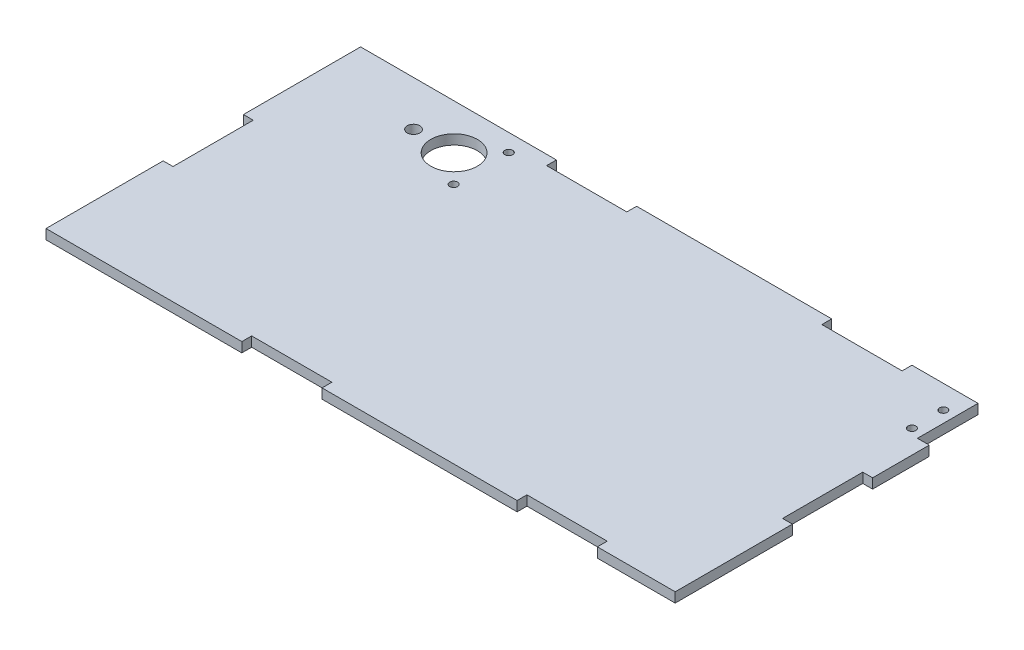
ISO-10303-21;
HEADER;
FILE_DESCRIPTION(('STEP AP214'),'2;1');
FILE_NAME('part.step','',(''),(''),'','','');
FILE_SCHEMA(('AUTOMOTIVE_DESIGN { 1 0 10303 214 1 1 1 1 }'));
ENDSEC;
DATA;
#1=APPLICATION_CONTEXT('core data for automotive mechanical design processes');
#2=APPLICATION_PROTOCOL_DEFINITION('international standard','automotive_design',2000,#1);
#3=PRODUCT_CONTEXT('',#1,'mechanical');
#4=PRODUCT('Part','Part','',(#3));
#5=PRODUCT_RELATED_PRODUCT_CATEGORY('part','',(#4));
#6=PRODUCT_DEFINITION_FORMATION('','',#4);
#7=PRODUCT_DEFINITION_CONTEXT('part definition',#1,'design');
#8=PRODUCT_DEFINITION('design','',#6,#7);
#9=PRODUCT_DEFINITION_SHAPE('','',#8);
#10=(LENGTH_UNIT() NAMED_UNIT(*) SI_UNIT(.MILLI.,.METRE.));
#11=(NAMED_UNIT(*) PLANE_ANGLE_UNIT() SI_UNIT($,.RADIAN.));
#12=(NAMED_UNIT(*) SI_UNIT($,.STERADIAN.) SOLID_ANGLE_UNIT());
#13=UNCERTAINTY_MEASURE_WITH_UNIT(LENGTH_MEASURE(1.E-05),#10,'distance_accuracy_value','');
#14=(GEOMETRIC_REPRESENTATION_CONTEXT(3) GLOBAL_UNCERTAINTY_ASSIGNED_CONTEXT((#13)) GLOBAL_UNIT_ASSIGNED_CONTEXT((#10,
#11,#12)) REPRESENTATION_CONTEXT('',''));
#15=CARTESIAN_POINT('',(0.,0.,0.));
#16=DIRECTION('',(0.,0.,1.));
#17=DIRECTION('',(1.,0.,0.));
#18=AXIS2_PLACEMENT_3D('',#15,#16,#17);
#19=CARTESIAN_POINT('',(127.875862068966,3.175,-50.3620689655172));
#20=DIRECTION('',(-1.,0.,0.));
#21=DIRECTION('',(0.,0.,1.));
#22=AXIS2_PLACEMENT_3D('',#19,#20,#21);
#23=PLANE('',#22);
#24=DIRECTION('',(0.,0.,-1.));
#25=VECTOR('',#24,1.);
#26=CARTESIAN_POINT('',(127.875862068966,0.,-50.3620689655172));
#27=LINE('',#26,#25);
#28=CARTESIAN_POINT('',(127.875862068966,0.,51.2379310344828));
#29=VERTEX_POINT('',#28);
#30=CARTESIAN_POINT('',(127.875862068966,0.,13.3919310344828));
#31=VERTEX_POINT('',#30);
#32=EDGE_CURVE('E478',#29,#31,#27,.T.);
#33=ORIENTED_EDGE('',*,*,#32,.T.);
#34=DIRECTION('',(0.,-1.,0.));
#35=VECTOR('',#34,1.);
#36=CARTESIAN_POINT('',(127.875862068966,0.,13.3919310344828));
#37=LINE('',#36,#35);
#38=CARTESIAN_POINT('',(127.875862068966,3.175,13.3919310344828));
#39=VERTEX_POINT('',#38);
#40=EDGE_CURVE('E257',#39,#31,#37,.T.);
#41=ORIENTED_EDGE('',*,*,#40,.F.);
#42=DIRECTION('',(0.,0.,-1.));
#43=VECTOR('',#42,1.);
#44=CARTESIAN_POINT('',(127.875862068966,3.175,-50.3620689655172));
#45=LINE('',#44,#43);
#46=CARTESIAN_POINT('',(127.875862068966,3.175,51.2379310344828));
#47=VERTEX_POINT('',#46);
#48=EDGE_CURVE('E461',#47,#39,#45,.T.);
#49=ORIENTED_EDGE('',*,*,#48,.F.);
#50=DIRECTION('',(0.,-1.,0.));
#51=VECTOR('',#50,1.);
#52=CARTESIAN_POINT('',(127.875862068966,3.175,51.2379310344828));
#53=LINE('',#52,#51);
#54=EDGE_CURVE('E42',#47,#29,#53,.T.);
#55=ORIENTED_EDGE('',*,*,#54,.T.);
#56=EDGE_LOOP('',(#33,#41,#49,#55));
#57=FACE_BOUND('',#56,.T.);
#58=ADVANCED_FACE('F34',(#57),#23,.F.);
#59=CARTESIAN_POINT('',(-75.3241379310345,3.175,-50.3620689655172));
#60=DIRECTION('',(1.,0.,0.));
#61=DIRECTION('',(0.,0.,-1.));
#62=AXIS2_PLACEMENT_3D('',#59,#60,#61);
#63=PLANE('',#62);
#64=DIRECTION('',(0.,0.,1.));
#65=VECTOR('',#64,1.);
#66=CARTESIAN_POINT('',(-75.3241379310345,3.175,-50.3620689655172));
#67=LINE('',#66,#65);
#68=CARTESIAN_POINT('',(-75.3241379310345,3.175,13.3919310344828));
#69=VERTEX_POINT('',#68);
#70=CARTESIAN_POINT('',(-75.3241379310345,3.175,51.2379310344828));
#71=VERTEX_POINT('',#70);
#72=EDGE_CURVE('E456',#69,#71,#67,.T.);
#73=ORIENTED_EDGE('',*,*,#72,.F.);
#74=DIRECTION('',(0.,1.,0.));
#75=VECTOR('',#74,1.);
#76=CARTESIAN_POINT('',(-75.3241379310345,3.175,13.3919310344828));
#77=LINE('',#76,#75);
#78=CARTESIAN_POINT('',(-75.3241379310345,0.,13.3919310344828));
#79=VERTEX_POINT('',#78);
#80=EDGE_CURVE('E278',#79,#69,#77,.T.);
#81=ORIENTED_EDGE('',*,*,#80,.F.);
#82=DIRECTION('',(0.,0.,1.));
#83=VECTOR('',#82,1.);
#84=CARTESIAN_POINT('',(-75.3241379310345,0.,-50.3620689655172));
#85=LINE('',#84,#83);
#86=CARTESIAN_POINT('',(-75.3241379310345,0.,51.2379310344828));
#87=VERTEX_POINT('',#86);
#88=EDGE_CURVE('E449',#79,#87,#85,.T.);
#89=ORIENTED_EDGE('',*,*,#88,.T.);
#90=DIRECTION('',(0.,-1.,0.));
#91=VECTOR('',#90,1.);
#92=CARTESIAN_POINT('',(-75.3241379310345,3.175,51.2379310344828));
#93=LINE('',#92,#91);
#94=EDGE_CURVE('E11',#71,#87,#93,.T.);
#95=ORIENTED_EDGE('',*,*,#94,.F.);
#96=EDGE_LOOP('',(#73,#81,#89,#95));
#97=FACE_BOUND('',#96,.T.);
#98=ADVANCED_FACE('F539',(#97),#63,.F.);
#99=CARTESIAN_POINT('',(-75.3241379310345,3.175,51.2379310344828));
#100=DIRECTION('',(0.,0.,-1.));
#101=DIRECTION('',(-1.,0.,0.));
#102=AXIS2_PLACEMENT_3D('',#99,#100,#101);
#103=PLANE('',#102);
#104=DIRECTION('',(1.,0.,0.));
#105=VECTOR('',#104,1.);
#106=CARTESIAN_POINT('',(-75.3241379310345,3.175,51.2379310344828));
#107=LINE('',#106,#105);
#108=CARTESIAN_POINT('',(13.8298620689655,3.175,51.2379310344828));
#109=VERTEX_POINT('',#108);
#110=CARTESIAN_POINT('',(76.8218620689655,3.175,51.2379310344828));
#111=VERTEX_POINT('',#110);
#112=EDGE_CURVE('E460',#109,#111,#107,.T.);
#113=ORIENTED_EDGE('',*,*,#112,.F.);
#114=DIRECTION('',(0.,1.,0.));
#115=VECTOR('',#114,1.);
#116=CARTESIAN_POINT('',(13.8298620689655,0.,51.2379310344828));
#117=LINE('',#116,#115);
#118=CARTESIAN_POINT('',(13.8298620689655,0.,51.2379310344828));
#119=VERTEX_POINT('',#118);
#120=EDGE_CURVE('E324',#119,#109,#117,.T.);
#121=ORIENTED_EDGE('',*,*,#120,.F.);
#122=DIRECTION('',(1.,0.,0.));
#123=VECTOR('',#122,1.);
#124=CARTESIAN_POINT('',(-75.3241379310345,0.,51.2379310344828));
#125=LINE('',#124,#123);
#126=CARTESIAN_POINT('',(76.8218620689655,0.,51.2379310344828));
#127=VERTEX_POINT('',#126);
#128=EDGE_CURVE('E477',#119,#127,#125,.T.);
#129=ORIENTED_EDGE('',*,*,#128,.T.);
#130=DIRECTION('',(0.,-1.,0.));
#131=VECTOR('',#130,1.);
#132=CARTESIAN_POINT('',(76.8218620689655,0.,51.2379310344828));
#133=LINE('',#132,#131);
#134=EDGE_CURVE('E342',#111,#127,#133,.T.);
#135=ORIENTED_EDGE('',*,*,#134,.F.);
#136=EDGE_LOOP('',(#113,#121,#129,#135));
#137=FACE_BOUND('',#136,.T.);
#138=ADVANCED_FACE('F516',(#137),#103,.F.);
#139=CARTESIAN_POINT('',(102.729862068966,3.17499999999999,51.2379310344828));
#140=VERTEX_POINT('',#139);
#141=EDGE_CURVE('E455',#140,#47,#107,.T.);
#142=ORIENTED_EDGE('',*,*,#141,.F.);
#143=DIRECTION('',(0.,1.,0.));
#144=VECTOR('',#143,1.);
#145=CARTESIAN_POINT('',(102.729862068966,0.,51.2379310344828));
#146=LINE('',#145,#144);
#147=CARTESIAN_POINT('',(102.729862068966,0.,51.2379310344828));
#148=VERTEX_POINT('',#147);
#149=EDGE_CURVE('E302',#148,#140,#146,.T.);
#150=ORIENTED_EDGE('',*,*,#149,.F.);
#151=EDGE_CURVE('E472',#148,#29,#125,.T.);
#152=ORIENTED_EDGE('',*,*,#151,.T.);
#153=ORIENTED_EDGE('',*,*,#54,.F.);
#154=EDGE_LOOP('',(#142,#150,#152,#153));
#155=FACE_BOUND('',#154,.T.);
#156=ADVANCED_FACE('F527',(#155),#103,.F.);
#157=CARTESIAN_POINT('',(-75.3241379310345,3.175,-50.3620689655172));
#158=DIRECTION('',(0.,0.,1.));
#159=DIRECTION('',(1.,0.,0.));
#160=AXIS2_PLACEMENT_3D('',#157,#158,#159);
#161=PLANE('',#160);
#162=DIRECTION('',(-1.,0.,0.));
#163=VECTOR('',#162,1.);
#164=CARTESIAN_POINT('',(-75.3241379310345,3.175,-50.3620689655172));
#165=LINE('',#164,#163);
#166=CARTESIAN_POINT('',(124.065862068966,3.175,-50.3620689655172));
#167=VERTEX_POINT('',#166);
#168=CARTESIAN_POINT('',(102.729862068966,3.175,-50.3620689655172));
#169=VERTEX_POINT('',#168);
#170=EDGE_CURVE('E465',#167,#169,#165,.T.);
#171=ORIENTED_EDGE('',*,*,#170,.F.);
#172=DIRECTION('',(0.,-1.,0.));
#173=VECTOR('',#172,1.);
#174=CARTESIAN_POINT('',(124.065862068966,3.175,-50.3620689655172));
#175=LINE('',#174,#173);
#176=CARTESIAN_POINT('',(124.065862068966,0.,-50.3620689655172));
#177=VERTEX_POINT('',#176);
#178=EDGE_CURVE('E236',#167,#177,#175,.T.);
#179=ORIENTED_EDGE('',*,*,#178,.T.);
#180=DIRECTION('',(-1.,0.,0.));
#181=VECTOR('',#180,1.);
#182=CARTESIAN_POINT('',(-75.3241379310345,0.,-50.3620689655172));
#183=LINE('',#182,#181);
#184=CARTESIAN_POINT('',(102.729862068966,0.,-50.3620689655172));
#185=VERTEX_POINT('',#184);
#186=EDGE_CURVE('E482',#177,#185,#183,.T.);
#187=ORIENTED_EDGE('',*,*,#186,.T.);
#188=DIRECTION('',(0.,-1.,0.));
#189=VECTOR('',#188,1.);
#190=CARTESIAN_POINT('',(102.729862068966,3.175,-50.3620689655172));
#191=LINE('',#190,#189);
#192=EDGE_CURVE('E376',#169,#185,#191,.T.);
#193=ORIENTED_EDGE('',*,*,#192,.F.);
#194=EDGE_LOOP('',(#171,#179,#187,#193));
#195=FACE_BOUND('',#194,.T.);
#196=ADVANCED_FACE('F529',(#195),#161,.F.);
#197=CARTESIAN_POINT('',(76.8218620689655,3.175,-50.3620689655172));
#198=VERTEX_POINT('',#197);
#199=CARTESIAN_POINT('',(13.8298620689655,3.175,-50.3620689655172));
#200=VERTEX_POINT('',#199);
#201=EDGE_CURVE('E468',#198,#200,#165,.T.);
#202=ORIENTED_EDGE('',*,*,#201,.F.);
#203=DIRECTION('',(0.,1.,0.));
#204=VECTOR('',#203,1.);
#205=CARTESIAN_POINT('',(76.8218620689655,3.175,-50.3620689655172));
#206=LINE('',#205,#204);
#207=CARTESIAN_POINT('',(76.8218620689655,0.,-50.3620689655172));
#208=VERTEX_POINT('',#207);
#209=EDGE_CURVE('E366',#208,#198,#206,.T.);
#210=ORIENTED_EDGE('',*,*,#209,.F.);
#211=CARTESIAN_POINT('',(13.8298620689655,0.,-50.3620689655172));
#212=VERTEX_POINT('',#211);
#213=EDGE_CURVE('E484',#208,#212,#183,.T.);
#214=ORIENTED_EDGE('',*,*,#213,.T.);
#215=DIRECTION('',(0.,-1.,0.));
#216=VECTOR('',#215,1.);
#217=CARTESIAN_POINT('',(13.8298620689655,3.175,-50.3620689655172));
#218=LINE('',#217,#216);
#219=EDGE_CURVE('E330',#200,#212,#218,.T.);
#220=ORIENTED_EDGE('',*,*,#219,.F.);
#221=EDGE_LOOP('',(#202,#210,#214,#220));
#222=FACE_BOUND('',#221,.T.);
#223=ADVANCED_FACE('F535',(#222),#161,.F.);
#224=CARTESIAN_POINT('',(0.,3.175,0.));
#225=DIRECTION('',(0.,1.,0.));
#226=DIRECTION('',(0.,0.,1.));
#227=AXIS2_PLACEMENT_3D('',#224,#225,#226);
#228=PLANE('',#227);
#229=DIRECTION('',(0.,0.,-1.));
#230=VECTOR('',#229,1.);
#231=CARTESIAN_POINT('',(124.065862068966,3.175,-50.3620689655172));
#232=LINE('',#231,#230);
#233=CARTESIAN_POINT('',(124.065862068966,3.175,-30.8040689655172));
#234=VERTEX_POINT('',#233);
#235=EDGE_CURVE('E240',#234,#167,#232,.T.);
#236=ORIENTED_EDGE('',*,*,#235,.T.);
#237=ORIENTED_EDGE('',*,*,#170,.T.);
#238=DIRECTION('',(0.,0.,-1.));
#239=VECTOR('',#238,1.);
#240=CARTESIAN_POINT('',(102.729862068966,3.175,-47.1870689655172));
#241=LINE('',#240,#239);
#242=CARTESIAN_POINT('',(102.729862068966,3.175,-47.1870689655172));
#243=VERTEX_POINT('',#242);
#244=EDGE_CURVE('E381',#243,#169,#241,.T.);
#245=ORIENTED_EDGE('',*,*,#244,.F.);
#246=DIRECTION('',(1.,0.,0.));
#247=VECTOR('',#246,1.);
#248=CARTESIAN_POINT('',(102.729862068966,3.175,-47.1870689655172));
#249=LINE('',#248,#247);
#250=CARTESIAN_POINT('',(76.8218620689655,3.175,-47.1870689655172));
#251=VERTEX_POINT('',#250);
#252=EDGE_CURVE('E372',#251,#243,#249,.T.);
#253=ORIENTED_EDGE('',*,*,#252,.F.);
#254=DIRECTION('',(0.,0.,-1.));
#255=VECTOR('',#254,1.);
#256=CARTESIAN_POINT('',(76.8218620689655,3.175,-47.1870689655172));
#257=LINE('',#256,#255);
#258=EDGE_CURVE('E385',#251,#198,#257,.T.);
#259=ORIENTED_EDGE('',*,*,#258,.T.);
#260=ORIENTED_EDGE('',*,*,#201,.T.);
#261=DIRECTION('',(0.,0.,-1.));
#262=VECTOR('',#261,1.);
#263=CARTESIAN_POINT('',(13.8298620689655,3.175,-47.1870689655172));
#264=LINE('',#263,#262);
#265=CARTESIAN_POINT('',(13.8298620689655,3.175,-47.1870689655172));
#266=VERTEX_POINT('',#265);
#267=EDGE_CURVE('E379',#266,#200,#264,.T.);
#268=ORIENTED_EDGE('',*,*,#267,.F.);
#269=DIRECTION('',(1.,0.,0.));
#270=VECTOR('',#269,1.);
#271=CARTESIAN_POINT('',(13.8298620689655,3.175,-47.1870689655172));
#272=LINE('',#271,#270);
#273=CARTESIAN_POINT('',(-12.0781379310345,3.175,-47.1870689655172));
#274=VERTEX_POINT('',#273);
#275=EDGE_CURVE('E402',#274,#266,#272,.T.);
#276=ORIENTED_EDGE('',*,*,#275,.F.);
#277=DIRECTION('',(0.,0.,-1.));
#278=VECTOR('',#277,1.);
#279=CARTESIAN_POINT('',(-12.0781379310345,3.175,-47.1870689655172));
#280=LINE('',#279,#278);
#281=CARTESIAN_POINT('',(-12.0781379310345,3.175,-50.3620689655172));
#282=VERTEX_POINT('',#281);
#283=EDGE_CURVE('E409',#274,#282,#280,.T.);
#284=ORIENTED_EDGE('',*,*,#283,.T.);
#285=CARTESIAN_POINT('',(-75.3241379310345,3.175,-50.3620689655172));
#286=VERTEX_POINT('',#285);
#287=EDGE_CURVE('E464',#282,#286,#165,.T.);
#288=ORIENTED_EDGE('',*,*,#287,.T.);
#289=CARTESIAN_POINT('',(-75.3241379310345,3.175,-12.5160689655172));
#290=VERTEX_POINT('',#289);
#291=EDGE_CURVE('E452',#286,#290,#67,.T.);
#292=ORIENTED_EDGE('',*,*,#291,.T.);
#293=DIRECTION('',(-1.,0.,0.));
#294=VECTOR('',#293,1.);
#295=CARTESIAN_POINT('',(-72.1491379310345,3.175,-12.5160689655172));
#296=LINE('',#295,#294);
#297=CARTESIAN_POINT('',(-72.1491379310345,3.175,-12.5160689655172));
#298=VERTEX_POINT('',#297);
#299=EDGE_CURVE('E306',#298,#290,#296,.T.);
#300=ORIENTED_EDGE('',*,*,#299,.F.);
#301=DIRECTION('',(0.,0.,-1.));
#302=VECTOR('',#301,1.);
#303=CARTESIAN_POINT('',(-72.1491379310345,3.175,13.3919310344828));
#304=LINE('',#303,#302);
#305=CARTESIAN_POINT('',(-72.1491379310345,3.175,13.3919310344828));
#306=VERTEX_POINT('',#305);
#307=EDGE_CURVE('E287',#306,#298,#304,.T.);
#308=ORIENTED_EDGE('',*,*,#307,.F.);
#309=DIRECTION('',(-1.,0.,0.));
#310=VECTOR('',#309,1.);
#311=CARTESIAN_POINT('',(-72.1491379310345,3.175,13.3919310344828));
#312=LINE('',#311,#310);
#313=EDGE_CURVE('E297',#306,#69,#312,.T.);
#314=ORIENTED_EDGE('',*,*,#313,.T.);
#315=ORIENTED_EDGE('',*,*,#72,.T.);
#316=CARTESIAN_POINT('',(-12.0781379310345,3.175,51.2379310344828));
#317=VERTEX_POINT('',#316);
#318=EDGE_CURVE('E457',#71,#317,#107,.T.);
#319=ORIENTED_EDGE('',*,*,#318,.T.);
#320=DIRECTION('',(0.,0.,1.));
#321=VECTOR('',#320,1.);
#322=CARTESIAN_POINT('',(-12.0781379310345,3.175,48.0629310344828));
#323=LINE('',#322,#321);
#324=CARTESIAN_POINT('',(-12.0781379310345,3.175,48.0629310344828));
#325=VERTEX_POINT('',#324);
#326=EDGE_CURVE('E334',#325,#317,#323,.T.);
#327=ORIENTED_EDGE('',*,*,#326,.F.);
#328=DIRECTION('',(-1.,0.,0.));
#329=VECTOR('',#328,1.);
#330=CARTESIAN_POINT('',(13.8298620689655,3.175,48.0629310344828));
#331=LINE('',#330,#329);
#332=CARTESIAN_POINT('',(13.8298620689655,3.175,48.0629310344828));
#333=VERTEX_POINT('',#332);
#334=EDGE_CURVE('E313',#333,#325,#331,.T.);
#335=ORIENTED_EDGE('',*,*,#334,.F.);
#336=DIRECTION('',(0.,0.,1.));
#337=VECTOR('',#336,1.);
#338=CARTESIAN_POINT('',(13.8298620689655,3.175,48.0629310344828));
#339=LINE('',#338,#337);
#340=EDGE_CURVE('E323',#333,#109,#339,.T.);
#341=ORIENTED_EDGE('',*,*,#340,.T.);
#342=ORIENTED_EDGE('',*,*,#112,.T.);
#343=DIRECTION('',(0.,0.,1.));
#344=VECTOR('',#343,1.);
#345=CARTESIAN_POINT('',(76.8218620689655,3.175,48.0629310344828));
#346=LINE('',#345,#344);
#347=CARTESIAN_POINT('',(76.8218620689655,3.175,48.0629310344828));
#348=VERTEX_POINT('',#347);
#349=EDGE_CURVE('E358',#348,#111,#346,.T.);
#350=ORIENTED_EDGE('',*,*,#349,.F.);
#351=DIRECTION('',(-1.,0.,0.));
#352=VECTOR('',#351,1.);
#353=CARTESIAN_POINT('',(102.729862068966,3.17499999999999,48.0629310344828));
#354=LINE('',#353,#352);
#355=CARTESIAN_POINT('',(102.729862068966,3.17499999999999,48.0629310344828));
#356=VERTEX_POINT('',#355);
#357=EDGE_CURVE('E341',#356,#348,#354,.T.);
#358=ORIENTED_EDGE('',*,*,#357,.F.);
#359=DIRECTION('',(0.,0.,1.));
#360=VECTOR('',#359,1.);
#361=CARTESIAN_POINT('',(102.729862068966,3.17499999999999,48.0629310344828));
#362=LINE('',#361,#360);
#363=EDGE_CURVE('E351',#356,#140,#362,.T.);
#364=ORIENTED_EDGE('',*,*,#363,.T.);
#365=ORIENTED_EDGE('',*,*,#141,.T.);
#366=ORIENTED_EDGE('',*,*,#48,.T.);
#367=DIRECTION('',(1.,0.,0.));
#368=VECTOR('',#367,1.);
#369=CARTESIAN_POINT('',(124.700862068966,3.175,13.3919310344828));
#370=LINE('',#369,#368);
#371=CARTESIAN_POINT('',(124.700862068966,3.175,13.3919310344828));
#372=VERTEX_POINT('',#371);
#373=EDGE_CURVE('E276',#372,#39,#370,.T.);
#374=ORIENTED_EDGE('',*,*,#373,.F.);
#375=DIRECTION('',(0.,0.,1.));
#376=VECTOR('',#375,1.);
#377=CARTESIAN_POINT('',(124.700862068966,3.175,13.3919310344828));
#378=LINE('',#377,#376);
#379=CARTESIAN_POINT('',(124.700862068966,3.175,-12.5160689655172));
#380=VERTEX_POINT('',#379);
#381=EDGE_CURVE('E270',#380,#372,#378,.T.);
#382=ORIENTED_EDGE('',*,*,#381,.F.);
#383=DIRECTION('',(1.,0.,0.));
#384=VECTOR('',#383,1.);
#385=CARTESIAN_POINT('',(124.700862068966,3.175,-12.5160689655172));
#386=LINE('',#385,#384);
#387=CARTESIAN_POINT('',(127.875862068966,3.175,-12.5160689655172));
#388=VERTEX_POINT('',#387);
#389=EDGE_CURVE('E279',#380,#388,#386,.T.);
#390=ORIENTED_EDGE('',*,*,#389,.T.);
#391=CARTESIAN_POINT('',(127.875862068966,3.175,-30.8040689655172));
#392=VERTEX_POINT('',#391);
#393=EDGE_CURVE('E251',#388,#392,#45,.T.);
#394=ORIENTED_EDGE('',*,*,#393,.T.);
#395=DIRECTION('',(-1.,0.,0.));
#396=VECTOR('',#395,1.);
#397=CARTESIAN_POINT('',(127.875862068966,3.175,-30.8040689655172));
#398=LINE('',#397,#396);
#399=EDGE_CURVE('E49',#392,#234,#398,.T.);
#400=ORIENTED_EDGE('',*,*,#399,.T.);
#401=EDGE_LOOP('',(#236,#237,#245,#253,#259,#260,#268,#276,#284,#288,#292,#300,#308,#314,#315,
#319,#327,#335,#341,#342,#350,#358,#364,#365,#366,#374,#382,#390,#394,#400));
#402=FACE_BOUND('',#401,.T.);
#403=CARTESIAN_POINT('',(-21.8591379310353,3.175,-44.7370689655172));
#404=DIRECTION('',(0.,1.,0.));
#405=DIRECTION('',(0.,0.,1.));
#406=AXIS2_PLACEMENT_3D('',#403,#404,#405);
#407=CIRCLE('',#406,1.27000000000001);
#408=CARTESIAN_POINT('',(-21.8591379310353,3.175,-43.4670689655172));
#409=VERTEX_POINT('',#408);
#410=EDGE_CURVE('E422',#409,#409,#407,.T.);
#411=ORIENTED_EDGE('',*,*,#410,.F.);
#412=EDGE_LOOP('',(#411));
#413=FACE_BOUND('',#412,.T.);
#414=CARTESIAN_POINT('',(-30.6091379310352,3.175,-35.8370689655172));
#415=DIRECTION('',(0.,1.,0.));
#416=DIRECTION('',(0.,0.,1.));
#417=AXIS2_PLACEMENT_3D('',#414,#415,#416);
#418=CIRCLE('',#417,7.51839999999999);
#419=CARTESIAN_POINT('',(-30.6091379310352,3.175,-28.3186689655172));
#420=VERTEX_POINT('',#419);
#421=EDGE_CURVE('E434',#420,#420,#418,.T.);
#422=ORIENTED_EDGE('',*,*,#421,.F.);
#423=EDGE_LOOP('',(#422));
#424=FACE_BOUND('',#423,.T.);
#425=CARTESIAN_POINT('',(120.357219560557,3.175,-32.7090689655172));
#426=DIRECTION('',(0.,1.,0.));
#427=DIRECTION('',(0.,0.,1.));
#428=AXIS2_PLACEMENT_3D('',#425,#426,#427);
#429=CIRCLE('',#428,1.27000000000004);
#430=CARTESIAN_POINT('',(120.357219560557,3.175,-31.4390689655171));
#431=VERTEX_POINT('',#430);
#432=EDGE_CURVE('E446',#431,#431,#429,.T.);
#433=ORIENTED_EDGE('',*,*,#432,.F.);
#434=EDGE_LOOP('',(#433));
#435=FACE_BOUND('',#434,.T.);
#436=CARTESIAN_POINT('',(120.357219560557,3.175,-42.8690689655172));
#437=DIRECTION('',(0.,1.,0.));
#438=DIRECTION('',(0.,0.,1.));
#439=AXIS2_PLACEMENT_3D('',#436,#437,#438);
#440=CIRCLE('',#439,1.27000000000006);
#441=CARTESIAN_POINT('',(120.357219560557,3.175,-41.5990689655171));
#442=VERTEX_POINT('',#441);
#443=EDGE_CURVE('E440',#442,#442,#440,.T.);
#444=ORIENTED_EDGE('',*,*,#443,.F.);
#445=EDGE_LOOP('',(#444));
#446=FACE_BOUND('',#445,.T.);
#447=CARTESIAN_POINT('',(-43.7091379310353,3.175,-35.8370689655172));
#448=DIRECTION('',(0.,1.,0.));
#449=DIRECTION('',(0.,0.,1.));
#450=AXIS2_PLACEMENT_3D('',#447,#448,#449);
#451=CIRCLE('',#450,2.03200000000001);
#452=CARTESIAN_POINT('',(-43.7091379310353,3.175,-33.8050689655172));
#453=VERTEX_POINT('',#452);
#454=EDGE_CURVE('E428',#453,#453,#451,.T.);
#455=ORIENTED_EDGE('',*,*,#454,.F.);
#456=EDGE_LOOP('',(#455));
#457=FACE_BOUND('',#456,.T.);
#458=CARTESIAN_POINT('',(-21.8591379310353,3.175,-26.9370689655172));
#459=DIRECTION('',(0.,1.,0.));
#460=DIRECTION('',(0.,0.,1.));
#461=AXIS2_PLACEMENT_3D('',#458,#459,#460);
#462=CIRCLE('',#461,1.27);
#463=CARTESIAN_POINT('',(-21.8591379310353,3.175,-25.6670689655172));
#464=VERTEX_POINT('',#463);
#465=EDGE_CURVE('E416',#464,#464,#462,.T.);
#466=ORIENTED_EDGE('',*,*,#465,.F.);
#467=EDGE_LOOP('',(#466));
#468=FACE_BOUND('',#467,.T.);
#469=ADVANCED_FACE('F247',(#402,#413,#424,#435,#446,#457,#468),#228,.T.);
#470=CARTESIAN_POINT('',(0.,0.,0.));
#471=DIRECTION('',(0.,1.,0.));
#472=DIRECTION('',(0.,0.,1.));
#473=AXIS2_PLACEMENT_3D('',#470,#471,#472);
#474=PLANE('',#473);
#475=ORIENTED_EDGE('',*,*,#186,.F.);
#476=DIRECTION('',(0.,0.,-1.));
#477=VECTOR('',#476,1.);
#478=CARTESIAN_POINT('',(124.065862068966,0.,-50.3620689655172));
#479=LINE('',#478,#477);
#480=CARTESIAN_POINT('',(124.065862068966,0.,-30.8040689655172));
#481=VERTEX_POINT('',#480);
#482=EDGE_CURVE('E252',#481,#177,#479,.T.);
#483=ORIENTED_EDGE('',*,*,#482,.F.);
#484=DIRECTION('',(-1.,0.,0.));
#485=VECTOR('',#484,1.);
#486=CARTESIAN_POINT('',(127.875862068966,0.,-30.8040689655172));
#487=LINE('',#486,#485);
#488=CARTESIAN_POINT('',(127.875862068966,0.,-30.8040689655172));
#489=VERTEX_POINT('',#488);
#490=EDGE_CURVE('E233',#489,#481,#487,.T.);
#491=ORIENTED_EDGE('',*,*,#490,.F.);
#492=CARTESIAN_POINT('',(127.875862068966,0.,-12.5160689655172));
#493=VERTEX_POINT('',#492);
#494=EDGE_CURVE('E476',#493,#489,#27,.T.);
#495=ORIENTED_EDGE('',*,*,#494,.F.);
#496=DIRECTION('',(1.,0.,0.));
#497=VECTOR('',#496,1.);
#498=CARTESIAN_POINT('',(124.700862068966,0.,-12.5160689655172));
#499=LINE('',#498,#497);
#500=CARTESIAN_POINT('',(124.700862068966,0.,-12.5160689655172));
#501=VERTEX_POINT('',#500);
#502=EDGE_CURVE('E57',#501,#493,#499,.T.);
#503=ORIENTED_EDGE('',*,*,#502,.F.);
#504=DIRECTION('',(0.,0.,-1.));
#505=VECTOR('',#504,1.);
#506=CARTESIAN_POINT('',(124.700862068966,0.,13.3919310344828));
#507=LINE('',#506,#505);
#508=CARTESIAN_POINT('',(124.700862068966,0.,13.3919310344828));
#509=VERTEX_POINT('',#508);
#510=EDGE_CURVE('E263',#509,#501,#507,.T.);
#511=ORIENTED_EDGE('',*,*,#510,.F.);
#512=DIRECTION('',(1.,0.,0.));
#513=VECTOR('',#512,1.);
#514=CARTESIAN_POINT('',(124.700862068966,0.,13.3919310344828));
#515=LINE('',#514,#513);
#516=EDGE_CURVE('E273',#509,#31,#515,.T.);
#517=ORIENTED_EDGE('',*,*,#516,.T.);
#518=ORIENTED_EDGE('',*,*,#32,.F.);
#519=ORIENTED_EDGE('',*,*,#151,.F.);
#520=DIRECTION('',(0.,0.,1.));
#521=VECTOR('',#520,1.);
#522=CARTESIAN_POINT('',(102.729862068966,0.,48.0629310344828));
#523=LINE('',#522,#521);
#524=CARTESIAN_POINT('',(102.729862068966,0.,48.0629310344828));
#525=VERTEX_POINT('',#524);
#526=EDGE_CURVE('E326',#525,#148,#523,.T.);
#527=ORIENTED_EDGE('',*,*,#526,.F.);
#528=DIRECTION('',(1.,0.,0.));
#529=VECTOR('',#528,1.);
#530=CARTESIAN_POINT('',(102.729862068966,0.,48.0629310344828));
#531=LINE('',#530,#529);
#532=CARTESIAN_POINT('',(76.8218620689655,0.,48.0629310344828));
#533=VERTEX_POINT('',#532);
#534=EDGE_CURVE('E348',#533,#525,#531,.T.);
#535=ORIENTED_EDGE('',*,*,#534,.F.);
#536=DIRECTION('',(0.,0.,1.));
#537=VECTOR('',#536,1.);
#538=CARTESIAN_POINT('',(76.8218620689655,0.,48.0629310344828));
#539=LINE('',#538,#537);
#540=EDGE_CURVE('E355',#533,#127,#539,.T.);
#541=ORIENTED_EDGE('',*,*,#540,.T.);
#542=ORIENTED_EDGE('',*,*,#128,.F.);
#543=DIRECTION('',(0.,0.,1.));
#544=VECTOR('',#543,1.);
#545=CARTESIAN_POINT('',(13.8298620689655,0.,48.0629310344828));
#546=LINE('',#545,#544);
#547=CARTESIAN_POINT('',(13.8298620689655,0.,48.0629310344828));
#548=VERTEX_POINT('',#547);
#549=EDGE_CURVE('E328',#548,#119,#546,.T.);
#550=ORIENTED_EDGE('',*,*,#549,.F.);
#551=DIRECTION('',(1.,0.,0.));
#552=VECTOR('',#551,1.);
#553=CARTESIAN_POINT('',(13.8298620689655,0.,48.0629310344828));
#554=LINE('',#553,#552);
#555=CARTESIAN_POINT('',(-12.0781379310345,0.,48.0629310344828));
#556=VERTEX_POINT('',#555);
#557=EDGE_CURVE('E320',#556,#548,#554,.T.);
#558=ORIENTED_EDGE('',*,*,#557,.F.);
#559=DIRECTION('',(0.,0.,1.));
#560=VECTOR('',#559,1.);
#561=CARTESIAN_POINT('',(-12.0781379310345,0.,48.0629310344828));
#562=LINE('',#561,#560);
#563=CARTESIAN_POINT('',(-12.0781379310345,0.,51.2379310344828));
#564=VERTEX_POINT('',#563);
#565=EDGE_CURVE('E331',#556,#564,#562,.T.);
#566=ORIENTED_EDGE('',*,*,#565,.T.);
#567=EDGE_CURVE('E473',#87,#564,#125,.T.);
#568=ORIENTED_EDGE('',*,*,#567,.F.);
#569=ORIENTED_EDGE('',*,*,#88,.F.);
#570=DIRECTION('',(-1.,0.,0.));
#571=VECTOR('',#570,1.);
#572=CARTESIAN_POINT('',(-72.1491379310345,0.,13.3919310344828));
#573=LINE('',#572,#571);
#574=CARTESIAN_POINT('',(-72.1491379310345,0.,13.3919310344828));
#575=VERTEX_POINT('',#574);
#576=EDGE_CURVE('E300',#575,#79,#573,.T.);
#577=ORIENTED_EDGE('',*,*,#576,.F.);
#578=DIRECTION('',(0.,0.,1.));
#579=VECTOR('',#578,1.);
#580=CARTESIAN_POINT('',(-72.1491379310345,0.,13.3919310344828));
#581=LINE('',#580,#579);
#582=CARTESIAN_POINT('',(-72.1491379310345,0.,-12.5160689655172));
#583=VERTEX_POINT('',#582);
#584=EDGE_CURVE('E294',#583,#575,#581,.T.);
#585=ORIENTED_EDGE('',*,*,#584,.F.);
#586=DIRECTION('',(-1.,0.,0.));
#587=VECTOR('',#586,1.);
#588=CARTESIAN_POINT('',(-72.1491379310345,0.,-12.5160689655172));
#589=LINE('',#588,#587);
#590=CARTESIAN_POINT('',(-75.3241379310345,0.,-12.5160689655172));
#591=VERTEX_POINT('',#590);
#592=EDGE_CURVE('E303',#583,#591,#589,.T.);
#593=ORIENTED_EDGE('',*,*,#592,.T.);
#594=CARTESIAN_POINT('',(-75.3241379310345,0.,-50.3620689655172));
#595=VERTEX_POINT('',#594);
#596=EDGE_CURVE('E469',#595,#591,#85,.T.);
#597=ORIENTED_EDGE('',*,*,#596,.F.);
#598=CARTESIAN_POINT('',(-12.0781379310345,0.,-50.3620689655172));
#599=VERTEX_POINT('',#598);
#600=EDGE_CURVE('E481',#599,#595,#183,.T.);
#601=ORIENTED_EDGE('',*,*,#600,.F.);
#602=DIRECTION('',(0.,0.,-1.));
#603=VECTOR('',#602,1.);
#604=CARTESIAN_POINT('',(-12.0781379310345,0.,-47.1870689655172));
#605=LINE('',#604,#603);
#606=CARTESIAN_POINT('',(-12.0781379310345,0.,-47.1870689655172));
#607=VERTEX_POINT('',#606);
#608=EDGE_CURVE('E412',#607,#599,#605,.T.);
#609=ORIENTED_EDGE('',*,*,#608,.F.);
#610=DIRECTION('',(-1.,0.,0.));
#611=VECTOR('',#610,1.);
#612=CARTESIAN_POINT('',(13.8298620689655,0.,-47.1870689655172));
#613=LINE('',#612,#611);
#614=CARTESIAN_POINT('',(13.8298620689655,0.,-47.1870689655172));
#615=VERTEX_POINT('',#614);
#616=EDGE_CURVE('E395',#615,#607,#613,.T.);
#617=ORIENTED_EDGE('',*,*,#616,.F.);
#618=DIRECTION('',(0.,0.,-1.));
#619=VECTOR('',#618,1.);
#620=CARTESIAN_POINT('',(13.8298620689655,0.,-47.1870689655172));
#621=LINE('',#620,#619);
#622=EDGE_CURVE('E405',#615,#212,#621,.T.);
#623=ORIENTED_EDGE('',*,*,#622,.T.);
#624=ORIENTED_EDGE('',*,*,#213,.F.);
#625=DIRECTION('',(0.,0.,-1.));
#626=VECTOR('',#625,1.);
#627=CARTESIAN_POINT('',(76.8218620689655,0.,-47.1870689655172));
#628=LINE('',#627,#626);
#629=CARTESIAN_POINT('',(76.8218620689655,0.,-47.1870689655172));
#630=VERTEX_POINT('',#629);
#631=EDGE_CURVE('E388',#630,#208,#628,.T.);
#632=ORIENTED_EDGE('',*,*,#631,.F.);
#633=DIRECTION('',(-1.,0.,0.));
#634=VECTOR('',#633,1.);
#635=CARTESIAN_POINT('',(102.729862068966,0.,-47.1870689655172));
#636=LINE('',#635,#634);
#637=CARTESIAN_POINT('',(102.729862068966,0.,-47.1870689655172));
#638=VERTEX_POINT('',#637);
#639=EDGE_CURVE('E365',#638,#630,#636,.T.);
#640=ORIENTED_EDGE('',*,*,#639,.F.);
#641=DIRECTION('',(0.,0.,-1.));
#642=VECTOR('',#641,1.);
#643=CARTESIAN_POINT('',(102.729862068966,0.,-47.1870689655172));
#644=LINE('',#643,#642);
#645=EDGE_CURVE('E375',#638,#185,#644,.T.);
#646=ORIENTED_EDGE('',*,*,#645,.T.);
#647=EDGE_LOOP('',(#475,#483,#491,#495,#503,#511,#517,#518,#519,#527,#535,#541,#542,#550,#558,
#566,#568,#569,#577,#585,#593,#597,#601,#609,#617,#623,#624,#632,#640,#646));
#648=FACE_BOUND('',#647,.T.);
#649=CARTESIAN_POINT('',(120.357219560557,0.,-32.7090689655172));
#650=DIRECTION('',(0.,1.,0.));
#651=DIRECTION('',(0.,0.,1.));
#652=AXIS2_PLACEMENT_3D('',#649,#650,#651);
#653=CIRCLE('',#652,1.27000000000004);
#654=CARTESIAN_POINT('',(120.357219560557,0.,-31.4390689655171));
#655=VERTEX_POINT('',#654);
#656=EDGE_CURVE('E443',#655,#655,#653,.T.);
#657=ORIENTED_EDGE('',*,*,#656,.T.);
#658=EDGE_LOOP('',(#657));
#659=FACE_BOUND('',#658,.T.);
#660=CARTESIAN_POINT('',(120.357219560557,0.,-42.8690689655172));
#661=DIRECTION('',(0.,1.,0.));
#662=DIRECTION('',(0.,0.,1.));
#663=AXIS2_PLACEMENT_3D('',#660,#661,#662);
#664=CIRCLE('',#663,1.27000000000006);
#665=CARTESIAN_POINT('',(120.357219560557,0.,-41.5990689655171));
#666=VERTEX_POINT('',#665);
#667=EDGE_CURVE('E437',#666,#666,#664,.T.);
#668=ORIENTED_EDGE('',*,*,#667,.T.);
#669=EDGE_LOOP('',(#668));
#670=FACE_BOUND('',#669,.T.);
#671=CARTESIAN_POINT('',(-30.6091379310352,0.,-35.8370689655172));
#672=DIRECTION('',(0.,1.,0.));
#673=DIRECTION('',(0.,0.,1.));
#674=AXIS2_PLACEMENT_3D('',#671,#672,#673);
#675=CIRCLE('',#674,7.51839999999999);
#676=CARTESIAN_POINT('',(-30.6091379310352,0.,-28.3186689655172));
#677=VERTEX_POINT('',#676);
#678=EDGE_CURVE('E431',#677,#677,#675,.T.);
#679=ORIENTED_EDGE('',*,*,#678,.T.);
#680=EDGE_LOOP('',(#679));
#681=FACE_BOUND('',#680,.T.);
#682=CARTESIAN_POINT('',(-43.7091379310353,0.,-35.8370689655172));
#683=DIRECTION('',(0.,1.,0.));
#684=DIRECTION('',(0.,0.,1.));
#685=AXIS2_PLACEMENT_3D('',#682,#683,#684);
#686=CIRCLE('',#685,2.03200000000001);
#687=CARTESIAN_POINT('',(-43.7091379310353,0.,-33.8050689655172));
#688=VERTEX_POINT('',#687);
#689=EDGE_CURVE('E425',#688,#688,#686,.T.);
#690=ORIENTED_EDGE('',*,*,#689,.T.);
#691=EDGE_LOOP('',(#690));
#692=FACE_BOUND('',#691,.T.);
#693=CARTESIAN_POINT('',(-21.8591379310353,0.,-44.7370689655172));
#694=DIRECTION('',(0.,1.,0.));
#695=DIRECTION('',(0.,0.,1.));
#696=AXIS2_PLACEMENT_3D('',#693,#694,#695);
#697=CIRCLE('',#696,1.27000000000001);
#698=CARTESIAN_POINT('',(-21.8591379310353,0.,-43.4670689655172));
#699=VERTEX_POINT('',#698);
#700=EDGE_CURVE('E419',#699,#699,#697,.T.);
#701=ORIENTED_EDGE('',*,*,#700,.T.);
#702=EDGE_LOOP('',(#701));
#703=FACE_BOUND('',#702,.T.);
#704=CARTESIAN_POINT('',(-21.8591379310353,0.,-26.9370689655172));
#705=DIRECTION('',(0.,1.,0.));
#706=DIRECTION('',(0.,0.,1.));
#707=AXIS2_PLACEMENT_3D('',#704,#705,#706);
#708=CIRCLE('',#707,1.27);
#709=CARTESIAN_POINT('',(-21.8591379310353,0.,-25.6670689655172));
#710=VERTEX_POINT('',#709);
#711=EDGE_CURVE('E384',#710,#710,#708,.T.);
#712=ORIENTED_EDGE('',*,*,#711,.T.);
#713=EDGE_LOOP('',(#712));
#714=FACE_BOUND('',#713,.T.);
#715=ADVANCED_FACE('F497',(#648,#659,#670,#681,#692,#703,#714),#474,.F.);
#716=ORIENTED_EDGE('',*,*,#596,.T.);
#717=DIRECTION('',(0.,-1.,0.));
#718=VECTOR('',#717,1.);
#719=CARTESIAN_POINT('',(-75.3241379310345,3.175,-12.5160689655172));
#720=LINE('',#719,#718);
#721=EDGE_CURVE('E288',#290,#591,#720,.T.);
#722=ORIENTED_EDGE('',*,*,#721,.F.);
#723=ORIENTED_EDGE('',*,*,#291,.F.);
#724=DIRECTION('',(0.,-1.,0.));
#725=VECTOR('',#724,1.);
#726=CARTESIAN_POINT('',(-75.3241379310345,3.175,-50.3620689655172));
#727=LINE('',#726,#725);
#728=EDGE_CURVE('E467',#286,#595,#727,.T.);
#729=ORIENTED_EDGE('',*,*,#728,.T.);
#730=EDGE_LOOP('',(#716,#722,#723,#729));
#731=FACE_BOUND('',#730,.T.);
#732=ADVANCED_FACE('F36',(#731),#63,.F.);
#733=ORIENTED_EDGE('',*,*,#567,.T.);
#734=DIRECTION('',(0.,-1.,0.));
#735=VECTOR('',#734,1.);
#736=CARTESIAN_POINT('',(-12.0781379310345,0.,51.2379310344828));
#737=LINE('',#736,#735);
#738=EDGE_CURVE('E314',#317,#564,#737,.T.);
#739=ORIENTED_EDGE('',*,*,#738,.F.);
#740=ORIENTED_EDGE('',*,*,#318,.F.);
#741=ORIENTED_EDGE('',*,*,#94,.T.);
#742=EDGE_LOOP('',(#733,#739,#740,#741));
#743=FACE_BOUND('',#742,.T.);
#744=ADVANCED_FACE('F530',(#743),#103,.F.);
#745=ORIENTED_EDGE('',*,*,#494,.T.);
#746=DIRECTION('',(0.,-1.,0.));
#747=VECTOR('',#746,1.);
#748=CARTESIAN_POINT('',(127.875862068966,3.175,-30.8040689655172));
#749=LINE('',#748,#747);
#750=EDGE_CURVE('E237',#392,#489,#749,.T.);
#751=ORIENTED_EDGE('',*,*,#750,.F.);
#752=ORIENTED_EDGE('',*,*,#393,.F.);
#753=DIRECTION('',(0.,1.,0.));
#754=VECTOR('',#753,1.);
#755=CARTESIAN_POINT('',(127.875862068966,0.,-12.5160689655172));
#756=LINE('',#755,#754);
#757=EDGE_CURVE('E264',#493,#388,#756,.T.);
#758=ORIENTED_EDGE('',*,*,#757,.F.);
#759=EDGE_LOOP('',(#745,#751,#752,#758));
#760=FACE_BOUND('',#759,.T.);
#761=ADVANCED_FACE('F542',(#760),#23,.F.);
#762=ORIENTED_EDGE('',*,*,#287,.F.);
#763=DIRECTION('',(0.,1.,0.));
#764=VECTOR('',#763,1.);
#765=CARTESIAN_POINT('',(-12.0781379310345,3.175,-50.3620689655172));
#766=LINE('',#765,#764);
#767=EDGE_CURVE('E396',#599,#282,#766,.T.);
#768=ORIENTED_EDGE('',*,*,#767,.F.);
#769=ORIENTED_EDGE('',*,*,#600,.T.);
#770=ORIENTED_EDGE('',*,*,#728,.F.);
#771=EDGE_LOOP('',(#762,#768,#769,#770));
#772=FACE_BOUND('',#771,.T.);
#773=ADVANCED_FACE('F538',(#772),#161,.F.);
#774=CARTESIAN_POINT('',(120.357219560557,3.175,-32.7090689655172));
#775=DIRECTION('',(0.,-1.,0.));
#776=DIRECTION('',(0.,0.,-1.));
#777=AXIS2_PLACEMENT_3D('',#774,#775,#776);
#778=CYLINDRICAL_SURFACE('',#777,1.27000000000004);
#779=ORIENTED_EDGE('',*,*,#432,.T.);
#780=EDGE_LOOP('',(#779));
#781=FACE_BOUND('',#780,.T.);
#782=ORIENTED_EDGE('',*,*,#656,.F.);
#783=EDGE_LOOP('',(#782));
#784=FACE_BOUND('',#783,.T.);
#785=ADVANCED_FACE('F554',(#781,#784),#778,.F.);
#786=CARTESIAN_POINT('',(120.357219560557,3.175,-42.8690689655172));
#787=DIRECTION('',(0.,-1.,0.));
#788=DIRECTION('',(0.,0.,-1.));
#789=AXIS2_PLACEMENT_3D('',#786,#787,#788);
#790=CYLINDRICAL_SURFACE('',#789,1.27000000000006);
#791=ORIENTED_EDGE('',*,*,#443,.T.);
#792=EDGE_LOOP('',(#791));
#793=FACE_BOUND('',#792,.T.);
#794=ORIENTED_EDGE('',*,*,#667,.F.);
#795=EDGE_LOOP('',(#794));
#796=FACE_BOUND('',#795,.T.);
#797=ADVANCED_FACE('F656',(#793,#796),#790,.F.);
#798=CARTESIAN_POINT('',(-30.6091379310352,3.175,-35.8370689655172));
#799=DIRECTION('',(0.,-1.,0.));
#800=DIRECTION('',(0.,0.,-1.));
#801=AXIS2_PLACEMENT_3D('',#798,#799,#800);
#802=CYLINDRICAL_SURFACE('',#801,7.51839999999999);
#803=ORIENTED_EDGE('',*,*,#421,.T.);
#804=EDGE_LOOP('',(#803));
#805=FACE_BOUND('',#804,.T.);
#806=ORIENTED_EDGE('',*,*,#678,.F.);
#807=EDGE_LOOP('',(#806));
#808=FACE_BOUND('',#807,.T.);
#809=ADVANCED_FACE('F652',(#805,#808),#802,.F.);
#810=CARTESIAN_POINT('',(-43.7091379310353,3.175,-35.8370689655172));
#811=DIRECTION('',(0.,-1.,0.));
#812=DIRECTION('',(0.,0.,-1.));
#813=AXIS2_PLACEMENT_3D('',#810,#811,#812);
#814=CYLINDRICAL_SURFACE('',#813,2.03200000000001);
#815=ORIENTED_EDGE('',*,*,#454,.T.);
#816=EDGE_LOOP('',(#815));
#817=FACE_BOUND('',#816,.T.);
#818=ORIENTED_EDGE('',*,*,#689,.F.);
#819=EDGE_LOOP('',(#818));
#820=FACE_BOUND('',#819,.T.);
#821=ADVANCED_FACE('F648',(#817,#820),#814,.F.);
#822=CARTESIAN_POINT('',(-21.8591379310353,3.175,-44.7370689655172));
#823=DIRECTION('',(0.,-1.,0.));
#824=DIRECTION('',(0.,0.,-1.));
#825=AXIS2_PLACEMENT_3D('',#822,#823,#824);
#826=CYLINDRICAL_SURFACE('',#825,1.27000000000001);
#827=ORIENTED_EDGE('',*,*,#410,.T.);
#828=EDGE_LOOP('',(#827));
#829=FACE_BOUND('',#828,.T.);
#830=ORIENTED_EDGE('',*,*,#700,.F.);
#831=EDGE_LOOP('',(#830));
#832=FACE_BOUND('',#831,.T.);
#833=ADVANCED_FACE('F644',(#829,#832),#826,.F.);
#834=CARTESIAN_POINT('',(-21.8591379310353,3.175,-26.9370689655172));
#835=DIRECTION('',(0.,-1.,0.));
#836=DIRECTION('',(0.,0.,-1.));
#837=AXIS2_PLACEMENT_3D('',#834,#835,#836);
#838=CYLINDRICAL_SURFACE('',#837,1.27);
#839=ORIENTED_EDGE('',*,*,#465,.T.);
#840=EDGE_LOOP('',(#839));
#841=FACE_BOUND('',#840,.T.);
#842=ORIENTED_EDGE('',*,*,#711,.F.);
#843=EDGE_LOOP('',(#842));
#844=FACE_BOUND('',#843,.T.);
#845=ADVANCED_FACE('F640',(#841,#844),#838,.F.);
#846=CARTESIAN_POINT('',(13.8298620689655,3.175,-47.1870689655172));
#847=DIRECTION('',(1.,0.,0.));
#848=DIRECTION('',(0.,0.,-1.));
#849=AXIS2_PLACEMENT_3D('',#846,#847,#848);
#850=PLANE('',#849);
#851=ORIENTED_EDGE('',*,*,#219,.T.);
#852=ORIENTED_EDGE('',*,*,#622,.F.);
#853=DIRECTION('',(0.,-1.,0.));
#854=VECTOR('',#853,1.);
#855=CARTESIAN_POINT('',(13.8298620689655,3.175,-47.1870689655172));
#856=LINE('',#855,#854);
#857=EDGE_CURVE('E392',#266,#615,#856,.T.);
#858=ORIENTED_EDGE('',*,*,#857,.F.);
#859=ORIENTED_EDGE('',*,*,#267,.T.);
#860=EDGE_LOOP('',(#851,#852,#858,#859));
#861=FACE_BOUND('',#860,.T.);
#862=ADVANCED_FACE('F636',(#861),#850,.F.);
#863=CARTESIAN_POINT('',(-12.0781379310345,3.175,-47.1870689655172));
#864=DIRECTION('',(-1.,0.,0.));
#865=DIRECTION('',(0.,-1.,0.));
#866=AXIS2_PLACEMENT_3D('',#863,#864,#865);
#867=PLANE('',#866);
#868=ORIENTED_EDGE('',*,*,#767,.T.);
#869=ORIENTED_EDGE('',*,*,#283,.F.);
#870=DIRECTION('',(0.,1.,0.));
#871=VECTOR('',#870,1.);
#872=CARTESIAN_POINT('',(-12.0781379310345,3.175,-47.1870689655172));
#873=LINE('',#872,#871);
#874=EDGE_CURVE('E399',#607,#274,#873,.T.);
#875=ORIENTED_EDGE('',*,*,#874,.F.);
#876=ORIENTED_EDGE('',*,*,#608,.T.);
#877=EDGE_LOOP('',(#868,#869,#875,#876));
#878=FACE_BOUND('',#877,.T.);
#879=ADVANCED_FACE('F632',(#878),#867,.F.);
#880=CARTESIAN_POINT('',(0.,0.,-47.1870689655172));
#881=DIRECTION('',(0.,0.,-1.));
#882=DIRECTION('',(-1.,0.,0.));
#883=AXIS2_PLACEMENT_3D('',#880,#881,#882);
#884=PLANE('',#883);
#885=ORIENTED_EDGE('',*,*,#857,.T.);
#886=ORIENTED_EDGE('',*,*,#616,.T.);
#887=ORIENTED_EDGE('',*,*,#874,.T.);
#888=ORIENTED_EDGE('',*,*,#275,.T.);
#889=EDGE_LOOP('',(#885,#886,#887,#888));
#890=FACE_BOUND('',#889,.T.);
#891=ADVANCED_FACE('F629',(#890),#884,.T.);
#892=CARTESIAN_POINT('',(102.729862068966,3.175,-47.1870689655172));
#893=DIRECTION('',(1.,0.,0.));
#894=DIRECTION('',(0.,0.,-1.));
#895=AXIS2_PLACEMENT_3D('',#892,#893,#894);
#896=PLANE('',#895);
#897=ORIENTED_EDGE('',*,*,#192,.T.);
#898=ORIENTED_EDGE('',*,*,#645,.F.);
#899=DIRECTION('',(0.,-1.,0.));
#900=VECTOR('',#899,1.);
#901=CARTESIAN_POINT('',(102.729862068966,3.175,-47.1870689655172));
#902=LINE('',#901,#900);
#903=EDGE_CURVE('E362',#243,#638,#902,.T.);
#904=ORIENTED_EDGE('',*,*,#903,.F.);
#905=ORIENTED_EDGE('',*,*,#244,.T.);
#906=EDGE_LOOP('',(#897,#898,#904,#905));
#907=FACE_BOUND('',#906,.T.);
#908=ADVANCED_FACE('F562',(#907),#896,.F.);
#909=CARTESIAN_POINT('',(76.8218620689655,3.175,-47.1870689655172));
#910=DIRECTION('',(-1.,0.,0.));
#911=DIRECTION('',(0.,0.,1.));
#912=AXIS2_PLACEMENT_3D('',#909,#910,#911);
#913=PLANE('',#912);
#914=ORIENTED_EDGE('',*,*,#209,.T.);
#915=ORIENTED_EDGE('',*,*,#258,.F.);
#916=DIRECTION('',(0.,1.,0.));
#917=VECTOR('',#916,1.);
#918=CARTESIAN_POINT('',(76.8218620689655,3.175,-47.1870689655172));
#919=LINE('',#918,#917);
#920=EDGE_CURVE('E369',#630,#251,#919,.T.);
#921=ORIENTED_EDGE('',*,*,#920,.F.);
#922=ORIENTED_EDGE('',*,*,#631,.T.);
#923=EDGE_LOOP('',(#914,#915,#921,#922));
#924=FACE_BOUND('',#923,.T.);
#925=ADVANCED_FACE('F624',(#924),#913,.F.);
#926=CARTESIAN_POINT('',(0.,0.,-47.1870689655172));
#927=DIRECTION('',(0.,0.,-1.));
#928=DIRECTION('',(-1.,0.,0.));
#929=AXIS2_PLACEMENT_3D('',#926,#927,#928);
#930=PLANE('',#929);
#931=ORIENTED_EDGE('',*,*,#903,.T.);
#932=ORIENTED_EDGE('',*,*,#639,.T.);
#933=ORIENTED_EDGE('',*,*,#920,.T.);
#934=ORIENTED_EDGE('',*,*,#252,.T.);
#935=EDGE_LOOP('',(#931,#932,#933,#934));
#936=FACE_BOUND('',#935,.T.);
#937=ADVANCED_FACE('F565',(#936),#930,.T.);
#938=CARTESIAN_POINT('',(102.729862068966,0.,48.0629310344828));
#939=DIRECTION('',(1.,0.,0.));
#940=DIRECTION('',(0.,0.,-1.));
#941=AXIS2_PLACEMENT_3D('',#938,#939,#940);
#942=PLANE('',#941);
#943=ORIENTED_EDGE('',*,*,#149,.T.);
#944=ORIENTED_EDGE('',*,*,#363,.F.);
#945=DIRECTION('',(0.,1.,0.));
#946=VECTOR('',#945,1.);
#947=CARTESIAN_POINT('',(102.729862068966,0.,48.0629310344828));
#948=LINE('',#947,#946);
#949=EDGE_CURVE('E338',#525,#356,#948,.T.);
#950=ORIENTED_EDGE('',*,*,#949,.F.);
#951=ORIENTED_EDGE('',*,*,#526,.T.);
#952=EDGE_LOOP('',(#943,#944,#950,#951));
#953=FACE_BOUND('',#952,.T.);
#954=ADVANCED_FACE('F526',(#953),#942,.F.);
#955=CARTESIAN_POINT('',(76.8218620689655,0.,48.0629310344828));
#956=DIRECTION('',(-1.,0.,0.));
#957=DIRECTION('',(0.,-1.,0.));
#958=AXIS2_PLACEMENT_3D('',#955,#956,#957);
#959=PLANE('',#958);
#960=ORIENTED_EDGE('',*,*,#134,.T.);
#961=ORIENTED_EDGE('',*,*,#540,.F.);
#962=DIRECTION('',(0.,-1.,0.));
#963=VECTOR('',#962,1.);
#964=CARTESIAN_POINT('',(76.8218620689655,0.,48.0629310344828));
#965=LINE('',#964,#963);
#966=EDGE_CURVE('E345',#348,#533,#965,.T.);
#967=ORIENTED_EDGE('',*,*,#966,.F.);
#968=ORIENTED_EDGE('',*,*,#349,.T.);
#969=EDGE_LOOP('',(#960,#961,#967,#968));
#970=FACE_BOUND('',#969,.T.);
#971=ADVANCED_FACE('F520',(#970),#959,.F.);
#972=CARTESIAN_POINT('',(0.,0.,48.0629310344828));
#973=DIRECTION('',(0.,0.,1.));
#974=DIRECTION('',(1.,0.,0.));
#975=AXIS2_PLACEMENT_3D('',#972,#973,#974);
#976=PLANE('',#975);
#977=ORIENTED_EDGE('',*,*,#949,.T.);
#978=ORIENTED_EDGE('',*,*,#357,.T.);
#979=ORIENTED_EDGE('',*,*,#966,.T.);
#980=ORIENTED_EDGE('',*,*,#534,.T.);
#981=EDGE_LOOP('',(#977,#978,#979,#980));
#982=FACE_BOUND('',#981,.T.);
#983=ADVANCED_FACE('F524',(#982),#976,.T.);
#984=CARTESIAN_POINT('',(13.8298620689655,0.,48.0629310344828));
#985=DIRECTION('',(1.,0.,0.));
#986=DIRECTION('',(0.,0.,-1.));
#987=AXIS2_PLACEMENT_3D('',#984,#985,#986);
#988=PLANE('',#987);
#989=ORIENTED_EDGE('',*,*,#120,.T.);
#990=ORIENTED_EDGE('',*,*,#340,.F.);
#991=DIRECTION('',(0.,1.,0.));
#992=VECTOR('',#991,1.);
#993=CARTESIAN_POINT('',(13.8298620689655,0.,48.0629310344828));
#994=LINE('',#993,#992);
#995=EDGE_CURVE('E310',#548,#333,#994,.T.);
#996=ORIENTED_EDGE('',*,*,#995,.F.);
#997=ORIENTED_EDGE('',*,*,#549,.T.);
#998=EDGE_LOOP('',(#989,#990,#996,#997));
#999=FACE_BOUND('',#998,.T.);
#1000=ADVANCED_FACE('F607',(#999),#988,.F.);
#1001=CARTESIAN_POINT('',(-12.0781379310345,0.,48.0629310344828));
#1002=DIRECTION('',(-1.,0.,0.));
#1003=DIRECTION('',(0.,0.,1.));
#1004=AXIS2_PLACEMENT_3D('',#1001,#1002,#1003);
#1005=PLANE('',#1004);
#1006=ORIENTED_EDGE('',*,*,#738,.T.);
#1007=ORIENTED_EDGE('',*,*,#565,.F.);
#1008=DIRECTION('',(0.,-1.,0.));
#1009=VECTOR('',#1008,1.);
#1010=CARTESIAN_POINT('',(-12.0781379310345,0.,48.0629310344828));
#1011=LINE('',#1010,#1009);
#1012=EDGE_CURVE('E317',#325,#556,#1011,.T.);
#1013=ORIENTED_EDGE('',*,*,#1012,.F.);
#1014=ORIENTED_EDGE('',*,*,#326,.T.);
#1015=EDGE_LOOP('',(#1006,#1007,#1013,#1014));
#1016=FACE_BOUND('',#1015,.T.);
#1017=ADVANCED_FACE('F602',(#1016),#1005,.F.);
#1018=CARTESIAN_POINT('',(0.,0.,48.0629310344828));
#1019=DIRECTION('',(0.,0.,1.));
#1020=DIRECTION('',(1.,0.,0.));
#1021=AXIS2_PLACEMENT_3D('',#1018,#1019,#1020);
#1022=PLANE('',#1021);
#1023=ORIENTED_EDGE('',*,*,#995,.T.);
#1024=ORIENTED_EDGE('',*,*,#334,.T.);
#1025=ORIENTED_EDGE('',*,*,#1012,.T.);
#1026=ORIENTED_EDGE('',*,*,#557,.T.);
#1027=EDGE_LOOP('',(#1023,#1024,#1025,#1026));
#1028=FACE_BOUND('',#1027,.T.);
#1029=ADVANCED_FACE('F605',(#1028),#1022,.T.);
#1030=CARTESIAN_POINT('',(-72.1491379310345,3.175,13.3919310344828));
#1031=DIRECTION('',(0.,0.,1.));
#1032=DIRECTION('',(0.,-1.,0.));
#1033=AXIS2_PLACEMENT_3D('',#1030,#1031,#1032);
#1034=PLANE('',#1033);
#1035=ORIENTED_EDGE('',*,*,#80,.T.);
#1036=ORIENTED_EDGE('',*,*,#313,.F.);
#1037=DIRECTION('',(0.,1.,0.));
#1038=VECTOR('',#1037,1.);
#1039=CARTESIAN_POINT('',(-72.1491379310345,3.175,13.3919310344828));
#1040=LINE('',#1039,#1038);
#1041=EDGE_CURVE('E284',#575,#306,#1040,.T.);
#1042=ORIENTED_EDGE('',*,*,#1041,.F.);
#1043=ORIENTED_EDGE('',*,*,#576,.T.);
#1044=EDGE_LOOP('',(#1035,#1036,#1042,#1043));
#1045=FACE_BOUND('',#1044,.T.);
#1046=ADVANCED_FACE('F719',(#1045),#1034,.F.);
#1047=CARTESIAN_POINT('',(-72.1491379310345,3.175,-12.5160689655172));
#1048=DIRECTION('',(0.,0.,-1.));
#1049=DIRECTION('',(-1.,0.,0.));
#1050=AXIS2_PLACEMENT_3D('',#1047,#1048,#1049);
#1051=PLANE('',#1050);
#1052=ORIENTED_EDGE('',*,*,#721,.T.);
#1053=ORIENTED_EDGE('',*,*,#592,.F.);
#1054=DIRECTION('',(0.,-1.,0.));
#1055=VECTOR('',#1054,1.);
#1056=CARTESIAN_POINT('',(-72.1491379310345,3.175,-12.5160689655172));
#1057=LINE('',#1056,#1055);
#1058=EDGE_CURVE('E291',#298,#583,#1057,.T.);
#1059=ORIENTED_EDGE('',*,*,#1058,.F.);
#1060=ORIENTED_EDGE('',*,*,#299,.T.);
#1061=EDGE_LOOP('',(#1052,#1053,#1059,#1060));
#1062=FACE_BOUND('',#1061,.T.);
#1063=ADVANCED_FACE('F586',(#1062),#1051,.F.);
#1064=CARTESIAN_POINT('',(-72.1491379310345,0.,0.));
#1065=DIRECTION('',(1.,0.,0.));
#1066=DIRECTION('',(0.,0.,-1.));
#1067=AXIS2_PLACEMENT_3D('',#1064,#1065,#1066);
#1068=PLANE('',#1067);
#1069=ORIENTED_EDGE('',*,*,#1041,.T.);
#1070=ORIENTED_EDGE('',*,*,#307,.T.);
#1071=ORIENTED_EDGE('',*,*,#1058,.T.);
#1072=ORIENTED_EDGE('',*,*,#584,.T.);
#1073=EDGE_LOOP('',(#1069,#1070,#1071,#1072));
#1074=FACE_BOUND('',#1073,.T.);
#1075=ADVANCED_FACE('F591',(#1074),#1068,.F.);
#1076=CARTESIAN_POINT('',(124.700862068966,0.,13.3919310344828));
#1077=DIRECTION('',(0.,0.,1.));
#1078=DIRECTION('',(1.,0.,0.));
#1079=AXIS2_PLACEMENT_3D('',#1076,#1077,#1078);
#1080=PLANE('',#1079);
#1081=ORIENTED_EDGE('',*,*,#40,.T.);
#1082=ORIENTED_EDGE('',*,*,#516,.F.);
#1083=DIRECTION('',(0.,-1.,0.));
#1084=VECTOR('',#1083,1.);
#1085=CARTESIAN_POINT('',(124.700862068966,0.,13.3919310344828));
#1086=LINE('',#1085,#1084);
#1087=EDGE_CURVE('E260',#372,#509,#1086,.T.);
#1088=ORIENTED_EDGE('',*,*,#1087,.F.);
#1089=ORIENTED_EDGE('',*,*,#373,.T.);
#1090=EDGE_LOOP('',(#1081,#1082,#1088,#1089));
#1091=FACE_BOUND('',#1090,.T.);
#1092=ADVANCED_FACE('F502',(#1091),#1080,.F.);
#1093=CARTESIAN_POINT('',(124.700862068966,0.,-12.5160689655172));
#1094=DIRECTION('',(0.,0.,-1.));
#1095=DIRECTION('',(0.,1.,0.));
#1096=AXIS2_PLACEMENT_3D('',#1093,#1094,#1095);
#1097=PLANE('',#1096);
#1098=ORIENTED_EDGE('',*,*,#757,.T.);
#1099=ORIENTED_EDGE('',*,*,#389,.F.);
#1100=DIRECTION('',(0.,1.,0.));
#1101=VECTOR('',#1100,1.);
#1102=CARTESIAN_POINT('',(124.700862068966,0.,-12.5160689655172));
#1103=LINE('',#1102,#1101);
#1104=EDGE_CURVE('E267',#501,#380,#1103,.T.);
#1105=ORIENTED_EDGE('',*,*,#1104,.F.);
#1106=ORIENTED_EDGE('',*,*,#502,.T.);
#1107=EDGE_LOOP('',(#1098,#1099,#1105,#1106));
#1108=FACE_BOUND('',#1107,.T.);
#1109=ADVANCED_FACE('F857',(#1108),#1097,.F.);
#1110=CARTESIAN_POINT('',(124.700862068966,0.,0.));
#1111=DIRECTION('',(-1.,0.,0.));
#1112=DIRECTION('',(0.,0.,1.));
#1113=AXIS2_PLACEMENT_3D('',#1110,#1111,#1112);
#1114=PLANE('',#1113);
#1115=ORIENTED_EDGE('',*,*,#1087,.T.);
#1116=ORIENTED_EDGE('',*,*,#510,.T.);
#1117=ORIENTED_EDGE('',*,*,#1104,.T.);
#1118=ORIENTED_EDGE('',*,*,#381,.T.);
#1119=EDGE_LOOP('',(#1115,#1116,#1117,#1118));
#1120=FACE_BOUND('',#1119,.T.);
#1121=ADVANCED_FACE('F504',(#1120),#1114,.F.);
#1122=CARTESIAN_POINT('',(124.065862068966,3.175,-50.3620689655172));
#1123=DIRECTION('',(-1.,0.,0.));
#1124=DIRECTION('',(0.,0.,1.));
#1125=AXIS2_PLACEMENT_3D('',#1122,#1123,#1124);
#1126=PLANE('',#1125);
#1127=ORIENTED_EDGE('',*,*,#482,.T.);
#1128=ORIENTED_EDGE('',*,*,#178,.F.);
#1129=ORIENTED_EDGE('',*,*,#235,.F.);
#1130=DIRECTION('',(0.,-1.,0.));
#1131=VECTOR('',#1130,1.);
#1132=CARTESIAN_POINT('',(124.065862068966,3.175,-30.8040689655172));
#1133=LINE('',#1132,#1131);
#1134=EDGE_CURVE('E229',#234,#481,#1133,.T.);
#1135=ORIENTED_EDGE('',*,*,#1134,.T.);
#1136=EDGE_LOOP('',(#1127,#1128,#1129,#1135));
#1137=FACE_BOUND('',#1136,.T.);
#1138=ADVANCED_FACE('F241',(#1137),#1126,.F.);
#1139=CARTESIAN_POINT('',(127.875862068966,3.175,-30.8040689655172));
#1140=DIRECTION('',(0.,0.,1.));
#1141=DIRECTION('',(1.,0.,0.));
#1142=AXIS2_PLACEMENT_3D('',#1139,#1140,#1141);
#1143=PLANE('',#1142);
#1144=ORIENTED_EDGE('',*,*,#490,.T.);
#1145=ORIENTED_EDGE('',*,*,#1134,.F.);
#1146=ORIENTED_EDGE('',*,*,#399,.F.);
#1147=ORIENTED_EDGE('',*,*,#750,.T.);
#1148=EDGE_LOOP('',(#1144,#1145,#1146,#1147));
#1149=FACE_BOUND('',#1148,.T.);
#1150=ADVANCED_FACE('F231',(#1149),#1143,.F.);
#1151=CLOSED_SHELL('',(#58,#98,#138,#156,#196,#223,#469,#715,#732,#744,#761,#773,#785,#797,#809,
#821,#833,#845,#862,#879,#891,#908,#925,#937,#954,#971,#983,#1000,#1017,#1029,#1046,#1063,#1075,
#1092,#1109,#1121,#1138,#1150));
#1152=MANIFOLD_SOLID_BREP('B2',#1151);
#1153=ADVANCED_BREP_SHAPE_REPRESENTATION('',(#18,#1152),#14);
#1154=SHAPE_DEFINITION_REPRESENTATION(#9,#1153);
ENDSEC;
END-ISO-10303-21;
